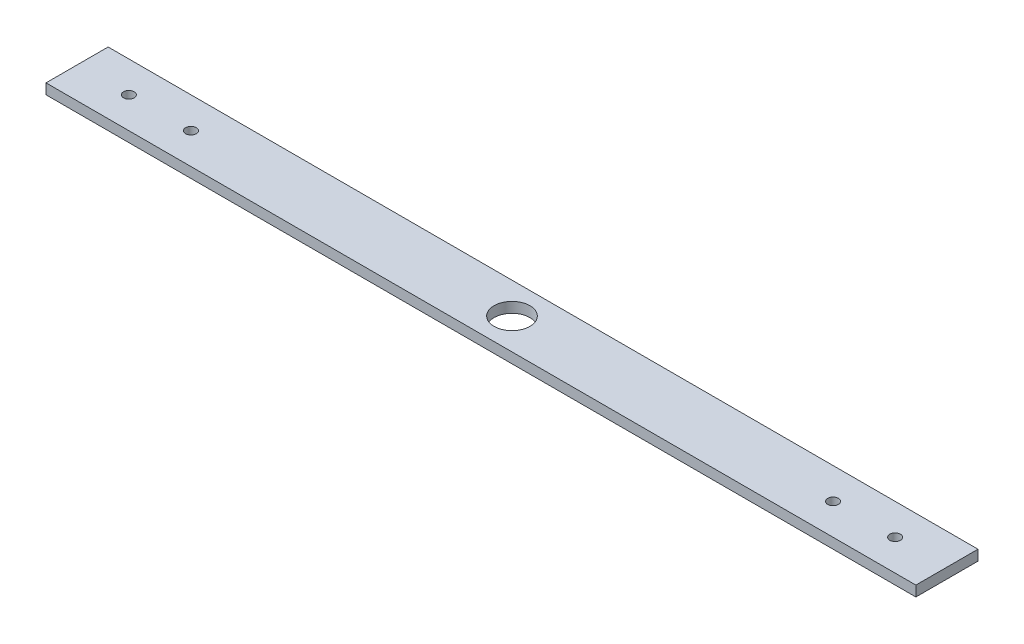
ISO-10303-21;
HEADER;
FILE_DESCRIPTION(('STEP AP214'),'2;1');
FILE_NAME('part.step','',(''),(''),'','','');
FILE_SCHEMA(('AUTOMOTIVE_DESIGN { 1 0 10303 214 1 1 1 1 }'));
ENDSEC;
DATA;
#1=APPLICATION_CONTEXT('core data for automotive mechanical design processes');
#2=APPLICATION_PROTOCOL_DEFINITION('international standard','automotive_design',2000,#1);
#3=PRODUCT_CONTEXT('',#1,'mechanical');
#4=PRODUCT('Part','Part','',(#3));
#5=PRODUCT_RELATED_PRODUCT_CATEGORY('part','',(#4));
#6=PRODUCT_DEFINITION_FORMATION('','',#4);
#7=PRODUCT_DEFINITION_CONTEXT('part definition',#1,'design');
#8=PRODUCT_DEFINITION('design','',#6,#7);
#9=PRODUCT_DEFINITION_SHAPE('','',#8);
#10=(LENGTH_UNIT() NAMED_UNIT(*) SI_UNIT(.MILLI.,.METRE.));
#11=(NAMED_UNIT(*) PLANE_ANGLE_UNIT() SI_UNIT($,.RADIAN.));
#12=(NAMED_UNIT(*) SI_UNIT($,.STERADIAN.) SOLID_ANGLE_UNIT());
#13=UNCERTAINTY_MEASURE_WITH_UNIT(LENGTH_MEASURE(1.E-05),#10,'distance_accuracy_value','');
#14=(GEOMETRIC_REPRESENTATION_CONTEXT(3) GLOBAL_UNCERTAINTY_ASSIGNED_CONTEXT((#13)) GLOBAL_UNIT_ASSIGNED_CONTEXT((#10,
#11,#12)) REPRESENTATION_CONTEXT('',''));
#15=CARTESIAN_POINT('',(0.,0.,0.));
#16=DIRECTION('',(0.,0.,1.));
#17=DIRECTION('',(1.,0.,0.));
#18=AXIS2_PLACEMENT_3D('',#15,#16,#17);
#19=CARTESIAN_POINT('',(266.7,6.35,-19.05));
#20=DIRECTION('',(-1.,0.,0.));
#21=DIRECTION('',(0.,0.,1.));
#22=AXIS2_PLACEMENT_3D('',#19,#20,#21);
#23=PLANE('',#22);
#24=DIRECTION('',(0.,0.,-1.));
#25=VECTOR('',#24,1.);
#26=CARTESIAN_POINT('',(266.7,0.,-19.05));
#27=LINE('',#26,#25);
#28=CARTESIAN_POINT('',(266.7,0.,19.05));
#29=VERTEX_POINT('',#28);
#30=CARTESIAN_POINT('',(266.7,0.,-19.05));
#31=VERTEX_POINT('',#30);
#32=EDGE_CURVE('E114',#29,#31,#27,.T.);
#33=ORIENTED_EDGE('',*,*,#32,.T.);
#34=DIRECTION('',(0.,-1.,0.));
#35=VECTOR('',#34,1.);
#36=CARTESIAN_POINT('',(266.7,6.35,-19.05));
#37=LINE('',#36,#35);
#38=CARTESIAN_POINT('',(266.7,6.35,-19.05));
#39=VERTEX_POINT('',#38);
#40=EDGE_CURVE('E11',#39,#31,#37,.T.);
#41=ORIENTED_EDGE('',*,*,#40,.F.);
#42=DIRECTION('',(0.,0.,-1.));
#43=VECTOR('',#42,1.);
#44=CARTESIAN_POINT('',(266.7,6.35,-19.05));
#45=LINE('',#44,#43);
#46=CARTESIAN_POINT('',(266.7,6.35,19.05));
#47=VERTEX_POINT('',#46);
#48=EDGE_CURVE('E95',#47,#39,#45,.T.);
#49=ORIENTED_EDGE('',*,*,#48,.F.);
#50=DIRECTION('',(0.,-1.,0.));
#51=VECTOR('',#50,1.);
#52=CARTESIAN_POINT('',(266.7,6.35,19.05));
#53=LINE('',#52,#51);
#54=EDGE_CURVE('E110',#47,#29,#53,.T.);
#55=ORIENTED_EDGE('',*,*,#54,.T.);
#56=EDGE_LOOP('',(#33,#41,#49,#55));
#57=FACE_BOUND('',#56,.T.);
#58=ADVANCED_FACE('F42',(#57),#23,.F.);
#59=CARTESIAN_POINT('',(-266.7,6.35,-19.05));
#60=DIRECTION('',(0.,0.,1.));
#61=DIRECTION('',(1.,0.,0.));
#62=AXIS2_PLACEMENT_3D('',#59,#60,#61);
#63=PLANE('',#62);
#64=DIRECTION('',(-1.,0.,0.));
#65=VECTOR('',#64,1.);
#66=CARTESIAN_POINT('',(-266.7,0.,-19.05));
#67=LINE('',#66,#65);
#68=CARTESIAN_POINT('',(-266.7,0.,-19.05));
#69=VERTEX_POINT('',#68);
#70=EDGE_CURVE('E100',#31,#69,#67,.T.);
#71=ORIENTED_EDGE('',*,*,#70,.T.);
#72=DIRECTION('',(0.,-1.,0.));
#73=VECTOR('',#72,1.);
#74=CARTESIAN_POINT('',(-266.7,6.35,-19.05));
#75=LINE('',#74,#73);
#76=CARTESIAN_POINT('',(-266.7,6.35,-19.05));
#77=VERTEX_POINT('',#76);
#78=EDGE_CURVE('E52',#77,#69,#75,.T.);
#79=ORIENTED_EDGE('',*,*,#78,.F.);
#80=DIRECTION('',(-1.,0.,0.));
#81=VECTOR('',#80,1.);
#82=CARTESIAN_POINT('',(-266.7,6.35,-19.05));
#83=LINE('',#82,#81);
#84=EDGE_CURVE('E90',#39,#77,#83,.T.);
#85=ORIENTED_EDGE('',*,*,#84,.F.);
#86=ORIENTED_EDGE('',*,*,#40,.T.);
#87=EDGE_LOOP('',(#71,#79,#85,#86));
#88=FACE_BOUND('',#87,.T.);
#89=ADVANCED_FACE('F99',(#88),#63,.F.);
#90=CARTESIAN_POINT('',(-266.7,6.35,-19.05));
#91=DIRECTION('',(1.,0.,0.));
#92=DIRECTION('',(0.,0.,-1.));
#93=AXIS2_PLACEMENT_3D('',#90,#91,#92);
#94=PLANE('',#93);
#95=DIRECTION('',(0.,0.,1.));
#96=VECTOR('',#95,1.);
#97=CARTESIAN_POINT('',(-266.7,0.,-19.05));
#98=LINE('',#97,#96);
#99=CARTESIAN_POINT('',(-266.7,0.,19.05));
#100=VERTEX_POINT('',#99);
#101=EDGE_CURVE('E77',#69,#100,#98,.T.);
#102=ORIENTED_EDGE('',*,*,#101,.T.);
#103=DIRECTION('',(0.,-1.,0.));
#104=VECTOR('',#103,1.);
#105=CARTESIAN_POINT('',(-266.7,6.35,19.05));
#106=LINE('',#105,#104);
#107=CARTESIAN_POINT('',(-266.7,6.35,19.05));
#108=VERTEX_POINT('',#107);
#109=EDGE_CURVE('E102',#108,#100,#106,.T.);
#110=ORIENTED_EDGE('',*,*,#109,.F.);
#111=DIRECTION('',(0.,0.,1.));
#112=VECTOR('',#111,1.);
#113=CARTESIAN_POINT('',(-266.7,6.35,-19.05));
#114=LINE('',#113,#112);
#115=EDGE_CURVE('E93',#77,#108,#114,.T.);
#116=ORIENTED_EDGE('',*,*,#115,.F.);
#117=ORIENTED_EDGE('',*,*,#78,.T.);
#118=EDGE_LOOP('',(#102,#110,#116,#117));
#119=FACE_BOUND('',#118,.T.);
#120=ADVANCED_FACE('F104',(#119),#94,.F.);
#121=CARTESIAN_POINT('',(-266.7,6.35,19.05));
#122=DIRECTION('',(0.,0.,-1.));
#123=DIRECTION('',(-1.,0.,0.));
#124=AXIS2_PLACEMENT_3D('',#121,#122,#123);
#125=PLANE('',#124);
#126=DIRECTION('',(1.,0.,0.));
#127=VECTOR('',#126,1.);
#128=CARTESIAN_POINT('',(-266.7,0.,19.05));
#129=LINE('',#128,#127);
#130=EDGE_CURVE('E83',#100,#29,#129,.T.);
#131=ORIENTED_EDGE('',*,*,#130,.T.);
#132=ORIENTED_EDGE('',*,*,#54,.F.);
#133=DIRECTION('',(1.,0.,0.));
#134=VECTOR('',#133,1.);
#135=CARTESIAN_POINT('',(-266.7,6.35,19.05));
#136=LINE('',#135,#134);
#137=EDGE_CURVE('E60',#108,#47,#136,.T.);
#138=ORIENTED_EDGE('',*,*,#137,.F.);
#139=ORIENTED_EDGE('',*,*,#109,.T.);
#140=EDGE_LOOP('',(#131,#132,#138,#139));
#141=FACE_BOUND('',#140,.T.);
#142=ADVANCED_FACE('F129',(#141),#125,.F.);
#143=CARTESIAN_POINT('',(0.,6.35,0.));
#144=DIRECTION('',(0.,1.,0.));
#145=DIRECTION('',(0.,0.,1.));
#146=AXIS2_PLACEMENT_3D('',#143,#144,#145);
#147=PLANE('',#146);
#148=CARTESIAN_POINT('',(-234.95,6.35,0.));
#149=DIRECTION('',(0.,1.,0.));
#150=DIRECTION('',(0.,0.,1.));
#151=AXIS2_PLACEMENT_3D('',#148,#149,#150);
#152=CIRCLE('',#151,3.26389999999999);
#153=CARTESIAN_POINT('',(-234.95,6.35,3.26389999999999));
#154=VERTEX_POINT('',#153);
#155=EDGE_CURVE('E170',#154,#154,#152,.T.);
#156=ORIENTED_EDGE('',*,*,#155,.F.);
#157=EDGE_LOOP('',(#156));
#158=FACE_BOUND('',#157,.T.);
#159=CARTESIAN_POINT('',(-196.85,6.35,0.));
#160=DIRECTION('',(0.,1.,0.));
#161=DIRECTION('',(0.,0.,1.));
#162=AXIS2_PLACEMENT_3D('',#159,#160,#161);
#163=CIRCLE('',#162,3.26389999999999);
#164=CARTESIAN_POINT('',(-196.85,6.35,3.26389999999999));
#165=VERTEX_POINT('',#164);
#166=EDGE_CURVE('E162',#165,#165,#163,.T.);
#167=ORIENTED_EDGE('',*,*,#166,.F.);
#168=EDGE_LOOP('',(#167));
#169=FACE_BOUND('',#168,.T.);
#170=CARTESIAN_POINT('',(234.95,6.35,0.));
#171=DIRECTION('',(0.,1.,0.));
#172=DIRECTION('',(0.,0.,1.));
#173=AXIS2_PLACEMENT_3D('',#170,#171,#172);
#174=CIRCLE('',#173,3.26389999999999);
#175=CARTESIAN_POINT('',(234.95,6.35,3.26389999999999));
#176=VERTEX_POINT('',#175);
#177=EDGE_CURVE('E154',#176,#176,#174,.T.);
#178=ORIENTED_EDGE('',*,*,#177,.F.);
#179=EDGE_LOOP('',(#178));
#180=FACE_BOUND('',#179,.T.);
#181=CARTESIAN_POINT('',(196.85,6.35,0.));
#182=DIRECTION('',(0.,1.,0.));
#183=DIRECTION('',(0.,0.,1.));
#184=AXIS2_PLACEMENT_3D('',#181,#182,#183);
#185=CIRCLE('',#184,3.26389999999999);
#186=CARTESIAN_POINT('',(196.85,6.35,3.26389999999999));
#187=VERTEX_POINT('',#186);
#188=EDGE_CURVE('E146',#187,#187,#185,.T.);
#189=ORIENTED_EDGE('',*,*,#188,.F.);
#190=EDGE_LOOP('',(#189));
#191=FACE_BOUND('',#190,.T.);
#192=CARTESIAN_POINT('',(0.,6.35,0.));
#193=DIRECTION('',(0.,1.,0.));
#194=DIRECTION('',(0.,0.,1.));
#195=AXIS2_PLACEMENT_3D('',#192,#193,#194);
#196=CIRCLE('',#195,11.);
#197=CARTESIAN_POINT('',(0.,6.35,11.));
#198=VERTEX_POINT('',#197);
#199=EDGE_CURVE('E138',#198,#198,#196,.T.);
#200=ORIENTED_EDGE('',*,*,#199,.F.);
#201=EDGE_LOOP('',(#200));
#202=FACE_BOUND('',#201,.T.);
#203=ORIENTED_EDGE('',*,*,#48,.T.);
#204=ORIENTED_EDGE('',*,*,#84,.T.);
#205=ORIENTED_EDGE('',*,*,#115,.T.);
#206=ORIENTED_EDGE('',*,*,#137,.T.);
#207=EDGE_LOOP('',(#203,#204,#205,#206));
#208=FACE_BOUND('',#207,.T.);
#209=ADVANCED_FACE('F91',(#158,#169,#180,#191,#202,#208),#147,.T.);
#210=CARTESIAN_POINT('',(0.,0.,0.));
#211=DIRECTION('',(0.,1.,0.));
#212=DIRECTION('',(0.,0.,1.));
#213=AXIS2_PLACEMENT_3D('',#210,#211,#212);
#214=PLANE('',#213);
#215=CARTESIAN_POINT('',(-234.95,0.,0.));
#216=DIRECTION('',(0.,1.,0.));
#217=DIRECTION('',(0.,0.,1.));
#218=AXIS2_PLACEMENT_3D('',#215,#216,#217);
#219=CIRCLE('',#218,3.26389999999999);
#220=CARTESIAN_POINT('',(-234.95,0.,3.26389999999999));
#221=VERTEX_POINT('',#220);
#222=EDGE_CURVE('E166',#221,#221,#219,.T.);
#223=ORIENTED_EDGE('',*,*,#222,.T.);
#224=EDGE_LOOP('',(#223));
#225=FACE_BOUND('',#224,.T.);
#226=CARTESIAN_POINT('',(-196.85,0.,0.));
#227=DIRECTION('',(0.,1.,0.));
#228=DIRECTION('',(0.,0.,1.));
#229=AXIS2_PLACEMENT_3D('',#226,#227,#228);
#230=CIRCLE('',#229,3.26389999999999);
#231=CARTESIAN_POINT('',(-196.85,0.,3.26389999999999));
#232=VERTEX_POINT('',#231);
#233=EDGE_CURVE('E158',#232,#232,#230,.T.);
#234=ORIENTED_EDGE('',*,*,#233,.T.);
#235=EDGE_LOOP('',(#234));
#236=FACE_BOUND('',#235,.T.);
#237=CARTESIAN_POINT('',(234.95,0.,0.));
#238=DIRECTION('',(0.,1.,0.));
#239=DIRECTION('',(0.,0.,1.));
#240=AXIS2_PLACEMENT_3D('',#237,#238,#239);
#241=CIRCLE('',#240,3.26389999999999);
#242=CARTESIAN_POINT('',(234.95,0.,3.26389999999999));
#243=VERTEX_POINT('',#242);
#244=EDGE_CURVE('E150',#243,#243,#241,.T.);
#245=ORIENTED_EDGE('',*,*,#244,.T.);
#246=EDGE_LOOP('',(#245));
#247=FACE_BOUND('',#246,.T.);
#248=CARTESIAN_POINT('',(196.85,0.,0.));
#249=DIRECTION('',(0.,1.,0.));
#250=DIRECTION('',(0.,0.,1.));
#251=AXIS2_PLACEMENT_3D('',#248,#249,#250);
#252=CIRCLE('',#251,3.26389999999999);
#253=CARTESIAN_POINT('',(196.85,0.,3.26389999999999));
#254=VERTEX_POINT('',#253);
#255=EDGE_CURVE('E142',#254,#254,#252,.T.);
#256=ORIENTED_EDGE('',*,*,#255,.T.);
#257=EDGE_LOOP('',(#256));
#258=FACE_BOUND('',#257,.T.);
#259=CARTESIAN_POINT('',(0.,0.,0.));
#260=DIRECTION('',(0.,1.,0.));
#261=DIRECTION('',(0.,0.,1.));
#262=AXIS2_PLACEMENT_3D('',#259,#260,#261);
#263=CIRCLE('',#262,11.);
#264=CARTESIAN_POINT('',(0.,0.,11.));
#265=VERTEX_POINT('',#264);
#266=EDGE_CURVE('E45',#265,#265,#263,.T.);
#267=ORIENTED_EDGE('',*,*,#266,.T.);
#268=EDGE_LOOP('',(#267));
#269=FACE_BOUND('',#268,.T.);
#270=ORIENTED_EDGE('',*,*,#32,.F.);
#271=ORIENTED_EDGE('',*,*,#130,.F.);
#272=ORIENTED_EDGE('',*,*,#101,.F.);
#273=ORIENTED_EDGE('',*,*,#70,.F.);
#274=EDGE_LOOP('',(#270,#271,#272,#273));
#275=FACE_BOUND('',#274,.T.);
#276=ADVANCED_FACE('F132',(#225,#236,#247,#258,#269,#275),#214,.F.);
#277=CARTESIAN_POINT('',(0.,-1.27,0.));
#278=DIRECTION('',(0.,1.,0.));
#279=DIRECTION('',(0.,0.,1.));
#280=AXIS2_PLACEMENT_3D('',#277,#278,#279);
#281=CYLINDRICAL_SURFACE('',#280,11.);
#282=ORIENTED_EDGE('',*,*,#199,.T.);
#283=EDGE_LOOP('',(#282));
#284=FACE_BOUND('',#283,.T.);
#285=ORIENTED_EDGE('',*,*,#266,.F.);
#286=EDGE_LOOP('',(#285));
#287=FACE_BOUND('',#286,.T.);
#288=ADVANCED_FACE('F190',(#284,#287),#281,.F.);
#289=CARTESIAN_POINT('',(196.85,6.35,0.));
#290=DIRECTION('',(0.,1.,0.));
#291=DIRECTION('',(0.,0.,1.));
#292=AXIS2_PLACEMENT_3D('',#289,#290,#291);
#293=CYLINDRICAL_SURFACE('',#292,3.26389999999999);
#294=ORIENTED_EDGE('',*,*,#255,.F.);
#295=EDGE_LOOP('',(#294));
#296=FACE_BOUND('',#295,.T.);
#297=ORIENTED_EDGE('',*,*,#188,.T.);
#298=EDGE_LOOP('',(#297));
#299=FACE_BOUND('',#298,.T.);
#300=ADVANCED_FACE('F193',(#296,#299),#293,.F.);
#301=CARTESIAN_POINT('',(234.95,6.35,0.));
#302=DIRECTION('',(0.,1.,0.));
#303=DIRECTION('',(0.,0.,1.));
#304=AXIS2_PLACEMENT_3D('',#301,#302,#303);
#305=CYLINDRICAL_SURFACE('',#304,3.26389999999999);
#306=ORIENTED_EDGE('',*,*,#244,.F.);
#307=EDGE_LOOP('',(#306));
#308=FACE_BOUND('',#307,.T.);
#309=ORIENTED_EDGE('',*,*,#177,.T.);
#310=EDGE_LOOP('',(#309));
#311=FACE_BOUND('',#310,.T.);
#312=ADVANCED_FACE('F280',(#308,#311),#305,.F.);
#313=CARTESIAN_POINT('',(-196.85,6.35,0.));
#314=DIRECTION('',(0.,1.,0.));
#315=DIRECTION('',(0.,0.,1.));
#316=AXIS2_PLACEMENT_3D('',#313,#314,#315);
#317=CYLINDRICAL_SURFACE('',#316,3.26389999999999);
#318=ORIENTED_EDGE('',*,*,#233,.F.);
#319=EDGE_LOOP('',(#318));
#320=FACE_BOUND('',#319,.T.);
#321=ORIENTED_EDGE('',*,*,#166,.T.);
#322=EDGE_LOOP('',(#321));
#323=FACE_BOUND('',#322,.T.);
#324=ADVANCED_FACE('F289',(#320,#323),#317,.F.);
#325=CARTESIAN_POINT('',(-234.95,6.35,0.));
#326=DIRECTION('',(0.,1.,0.));
#327=DIRECTION('',(0.,0.,1.));
#328=AXIS2_PLACEMENT_3D('',#325,#326,#327);
#329=CYLINDRICAL_SURFACE('',#328,3.26389999999999);
#330=ORIENTED_EDGE('',*,*,#222,.F.);
#331=EDGE_LOOP('',(#330));
#332=FACE_BOUND('',#331,.T.);
#333=ORIENTED_EDGE('',*,*,#155,.T.);
#334=EDGE_LOOP('',(#333));
#335=FACE_BOUND('',#334,.T.);
#336=ADVANCED_FACE('F177',(#332,#335),#329,.F.);
#337=CLOSED_SHELL('',(#58,#89,#120,#142,#209,#276,#288,#300,#312,#324,#336));
#338=MANIFOLD_SOLID_BREP('B2',#337);
#339=ADVANCED_BREP_SHAPE_REPRESENTATION('',(#18,#338),#14);
#340=SHAPE_DEFINITION_REPRESENTATION(#9,#339);
ENDSEC;
END-ISO-10303-21;
